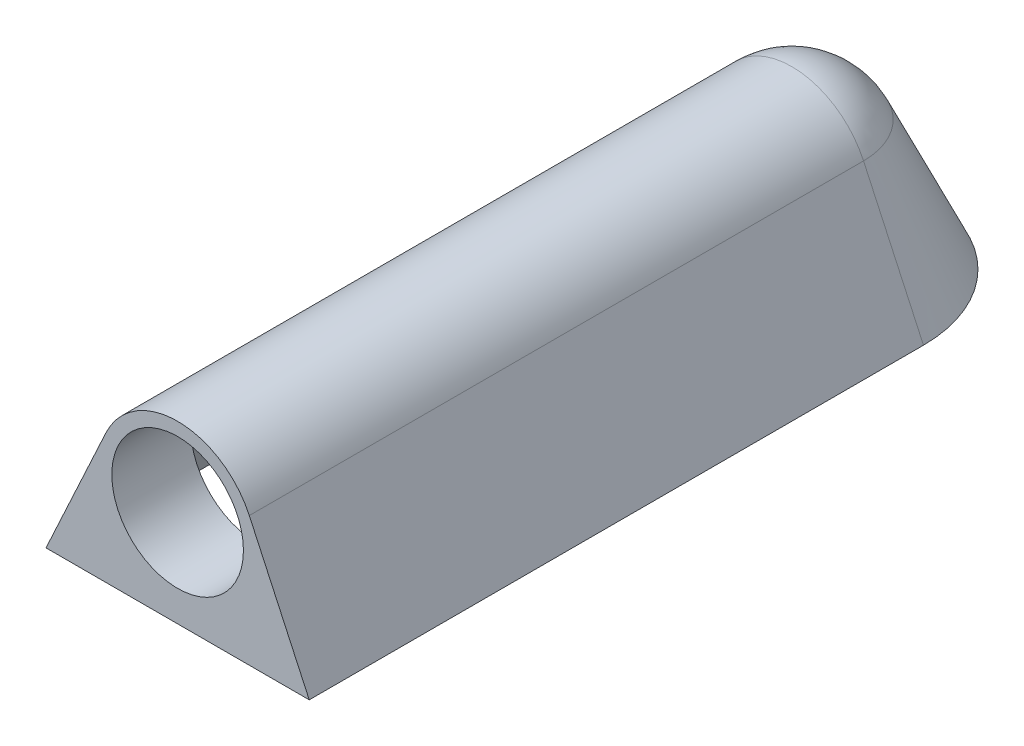
ISO-10303-21;
HEADER;
FILE_DESCRIPTION(('STEP AP214'),'2;1');
FILE_NAME('part.step','',(''),(''),'','','');
FILE_SCHEMA(('AUTOMOTIVE_DESIGN { 1 0 10303 214 1 1 1 1 }'));
ENDSEC;
DATA;
#1=APPLICATION_CONTEXT('core data for automotive mechanical design processes');
#2=APPLICATION_PROTOCOL_DEFINITION('international standard','automotive_design',2000,#1);
#3=PRODUCT_CONTEXT('',#1,'mechanical');
#4=PRODUCT('Part','Part','',(#3));
#5=PRODUCT_RELATED_PRODUCT_CATEGORY('part','',(#4));
#6=PRODUCT_DEFINITION_FORMATION('','',#4);
#7=PRODUCT_DEFINITION_CONTEXT('part definition',#1,'design');
#8=PRODUCT_DEFINITION('design','',#6,#7);
#9=PRODUCT_DEFINITION_SHAPE('','',#8);
#10=(LENGTH_UNIT() NAMED_UNIT(*) SI_UNIT(.MILLI.,.METRE.));
#11=(NAMED_UNIT(*) PLANE_ANGLE_UNIT() SI_UNIT($,.RADIAN.));
#12=(NAMED_UNIT(*) SI_UNIT($,.STERADIAN.) SOLID_ANGLE_UNIT());
#13=UNCERTAINTY_MEASURE_WITH_UNIT(LENGTH_MEASURE(1.E-05),#10,'distance_accuracy_value','');
#14=(GEOMETRIC_REPRESENTATION_CONTEXT(3) GLOBAL_UNCERTAINTY_ASSIGNED_CONTEXT((#13)) GLOBAL_UNIT_ASSIGNED_CONTEXT((#10,
#11,#12)) REPRESENTATION_CONTEXT('',''));
#15=CARTESIAN_POINT('',(0.,0.,0.));
#16=DIRECTION('',(0.,0.,1.));
#17=DIRECTION('',(1.,0.,0.));
#18=AXIS2_PLACEMENT_3D('',#15,#16,#17);
#19=CARTESIAN_POINT('',(0.,0.,0.));
#20=DIRECTION('',(0.,-1.,0.));
#21=DIRECTION('',(0.,0.,-1.));
#22=AXIS2_PLACEMENT_3D('',#19,#20,#21);
#23=PLANE('',#22);
#24=CARTESIAN_POINT('',(0.,0.,0.));
#25=DIRECTION('',(0.,-1.,0.));
#26=DIRECTION('',(0.,0.,-1.));
#27=AXIS2_PLACEMENT_3D('',#24,#25,#26);
#28=CIRCLE('',#27,13.8983243360726);
#29=CARTESIAN_POINT('',(-13.8983243360726,0.,1.01306614724094E-13));
#30=VERTEX_POINT('',#29);
#31=CARTESIAN_POINT('',(13.8983243360726,0.,0.));
#32=VERTEX_POINT('',#31);
#33=EDGE_CURVE('E145',#30,#32,#28,.T.);
#34=ORIENTED_EDGE('',*,*,#33,.F.);
#35=DIRECTION('',(0.,0.,-1.));
#36=VECTOR('',#35,1.);
#37=CARTESIAN_POINT('',(-13.8983243360726,0.,70.));
#38=LINE('',#37,#36);
#39=CARTESIAN_POINT('',(-13.8983243360726,0.,69.));
#40=VERTEX_POINT('',#39);
#41=EDGE_CURVE('E149',#40,#30,#38,.T.);
#42=ORIENTED_EDGE('',*,*,#41,.F.);
#43=DIRECTION('',(1.,0.,0.));
#44=VECTOR('',#43,1.);
#45=CARTESIAN_POINT('',(0.,0.,69.));
#46=LINE('',#45,#44);
#47=CARTESIAN_POINT('',(13.8983243360726,0.,69.));
#48=VERTEX_POINT('',#47);
#49=EDGE_CURVE('E53',#40,#48,#46,.T.);
#50=ORIENTED_EDGE('',*,*,#49,.T.);
#51=DIRECTION('',(0.,0.,-1.));
#52=VECTOR('',#51,1.);
#53=CARTESIAN_POINT('',(13.8983243360726,0.,0.));
#54=LINE('',#53,#52);
#55=EDGE_CURVE('E157',#48,#32,#54,.T.);
#56=ORIENTED_EDGE('',*,*,#55,.T.);
#57=EDGE_LOOP('',(#34,#42,#50,#56));
#58=FACE_BOUND('',#57,.T.);
#59=CARTESIAN_POINT('',(0.,0.,0.));
#60=DIRECTION('',(0.,-1.,0.));
#61=DIRECTION('',(0.,0.,-1.));
#62=AXIS2_PLACEMENT_3D('',#59,#60,#61);
#63=CIRCLE('',#62,15.);
#64=CARTESIAN_POINT('',(-15.,0.,0.));
#65=VERTEX_POINT('',#64);
#66=CARTESIAN_POINT('',(15.,0.,0.));
#67=VERTEX_POINT('',#66);
#68=EDGE_CURVE('E11',#65,#67,#63,.T.);
#69=ORIENTED_EDGE('',*,*,#68,.T.);
#70=DIRECTION('',(0.,0.,-1.));
#71=VECTOR('',#70,1.);
#72=CARTESIAN_POINT('',(15.,0.,70.));
#73=LINE('',#72,#71);
#74=CARTESIAN_POINT('',(15.,0.,70.));
#75=VERTEX_POINT('',#74);
#76=EDGE_CURVE('E200',#75,#67,#73,.T.);
#77=ORIENTED_EDGE('',*,*,#76,.F.);
#78=DIRECTION('',(1.,0.,0.));
#79=VECTOR('',#78,1.);
#80=CARTESIAN_POINT('',(-15.,0.,70.));
#81=LINE('',#80,#79);
#82=CARTESIAN_POINT('',(-15.,0.,70.));
#83=VERTEX_POINT('',#82);
#84=EDGE_CURVE('E190',#83,#75,#81,.T.);
#85=ORIENTED_EDGE('',*,*,#84,.F.);
#86=DIRECTION('',(0.,0.,-1.));
#87=VECTOR('',#86,1.);
#88=CARTESIAN_POINT('',(-15.,0.,70.));
#89=LINE('',#88,#87);
#90=EDGE_CURVE('E202',#83,#65,#89,.T.);
#91=ORIENTED_EDGE('',*,*,#90,.T.);
#92=EDGE_LOOP('',(#69,#77,#85,#91));
#93=FACE_BOUND('',#92,.T.);
#94=ADVANCED_FACE('F38',(#58,#93),#23,.T.);
#95=CARTESIAN_POINT('',(0.,0.,0.));
#96=DIRECTION('',(0.,-1.,0.));
#97=DIRECTION('',(0.,0.,-1.));
#98=AXIS2_PLACEMENT_3D('',#95,#96,#97);
#99=CONICAL_SURFACE('',#98,15.,0.433006862649807);
#100=CARTESIAN_POINT('',(0.,14.7764184406747,0.));
#101=DIRECTION('',(0.,-1.,0.));
#102=DIRECTION('',(0.,0.,-1.));
#103=AXIS2_PLACEMENT_3D('',#100,#101,#102);
#104=CIRCLE('',#103,8.16937352316148);
#105=CARTESIAN_POINT('',(-8.16937352316148,14.7764184406747,0.));
#106=VERTEX_POINT('',#105);
#107=CARTESIAN_POINT('',(8.16937352316148,14.7764184406747,0.));
#108=VERTEX_POINT('',#107);
#109=EDGE_CURVE('E46',#106,#108,#104,.T.);
#110=ORIENTED_EDGE('',*,*,#109,.T.);
#111=DIRECTION('',(-0.41960204896386,0.907708169240164,0.));
#112=VECTOR('',#111,1.);
#113=CARTESIAN_POINT('',(15.,0.,0.));
#114=LINE('',#113,#112);
#115=EDGE_CURVE('E204',#67,#108,#114,.T.);
#116=ORIENTED_EDGE('',*,*,#115,.F.);
#117=ORIENTED_EDGE('',*,*,#68,.F.);
#118=DIRECTION('',(0.41960204896386,0.907708169240164,0.));
#119=VECTOR('',#118,1.);
#120=CARTESIAN_POINT('',(-15.,0.,1.04744440165294E-13));
#121=LINE('',#120,#119);
#122=EDGE_CURVE('E206',#65,#106,#121,.T.);
#123=ORIENTED_EDGE('',*,*,#122,.T.);
#124=EDGE_LOOP('',(#110,#116,#117,#123));
#125=FACE_BOUND('',#124,.T.);
#126=ADVANCED_FACE('F40',(#125),#99,.T.);
#127=CARTESIAN_POINT('',(0.,11.,0.));
#128=DIRECTION('',(0.,-1.,0.));
#129=DIRECTION('',(-1.,0.,0.));
#130=AXIS2_PLACEMENT_3D('',#127,#128,#129);
#131=SPHERICAL_SURFACE('',#130,9.);
#132=CARTESIAN_POINT('',(0.,11.,0.));
#133=DIRECTION('',(0.,0.,-1.));
#134=DIRECTION('',(-1.,0.,0.));
#135=AXIS2_PLACEMENT_3D('',#132,#133,#134);
#136=CIRCLE('',#135,9.);
#137=EDGE_CURVE('E209',#106,#108,#136,.T.);
#138=ORIENTED_EDGE('',*,*,#137,.T.);
#139=ORIENTED_EDGE('',*,*,#109,.F.);
#140=EDGE_LOOP('',(#138,#139));
#141=FACE_BOUND('',#140,.T.);
#142=ADVANCED_FACE('F218',(#141),#131,.T.);
#143=CARTESIAN_POINT('',(-8.16937352316148,14.7764184406747,70.));
#144=DIRECTION('',(0.907708169240164,-0.41960204896386,0.));
#145=DIRECTION('',(0.41960204896386,0.907708169240164,0.));
#146=AXIS2_PLACEMENT_3D('',#143,#144,#145);
#147=PLANE('',#146);
#148=ORIENTED_EDGE('',*,*,#122,.F.);
#149=ORIENTED_EDGE('',*,*,#90,.F.);
#150=DIRECTION('',(-0.41960204896386,-0.907708169240164,0.));
#151=VECTOR('',#150,1.);
#152=CARTESIAN_POINT('',(-8.16937352316148,14.7764184406747,70.));
#153=LINE('',#152,#151);
#154=CARTESIAN_POINT('',(-8.16937352316148,14.7764184406747,70.));
#155=VERTEX_POINT('',#154);
#156=EDGE_CURVE('E187',#155,#83,#153,.T.);
#157=ORIENTED_EDGE('',*,*,#156,.F.);
#158=DIRECTION('',(0.,0.,-1.));
#159=VECTOR('',#158,1.);
#160=CARTESIAN_POINT('',(-8.16937352316148,14.7764184406747,70.));
#161=LINE('',#160,#159);
#162=EDGE_CURVE('E196',#155,#106,#161,.T.);
#163=ORIENTED_EDGE('',*,*,#162,.T.);
#164=EDGE_LOOP('',(#148,#149,#157,#163));
#165=FACE_BOUND('',#164,.T.);
#166=ADVANCED_FACE('F223',(#165),#147,.F.);
#167=CARTESIAN_POINT('',(15.,0.,70.));
#168=DIRECTION('',(-0.907708169240164,-0.41960204896386,0.));
#169=DIRECTION('',(0.41960204896386,-0.907708169240164,0.));
#170=AXIS2_PLACEMENT_3D('',#167,#168,#169);
#171=PLANE('',#170);
#172=ORIENTED_EDGE('',*,*,#115,.T.);
#173=DIRECTION('',(0.,0.,-1.));
#174=VECTOR('',#173,1.);
#175=CARTESIAN_POINT('',(8.16937352316148,14.7764184406747,70.));
#176=LINE('',#175,#174);
#177=CARTESIAN_POINT('',(8.16937352316148,14.7764184406747,70.));
#178=VERTEX_POINT('',#177);
#179=EDGE_CURVE('E61',#178,#108,#176,.T.);
#180=ORIENTED_EDGE('',*,*,#179,.F.);
#181=DIRECTION('',(-0.41960204896386,0.907708169240164,0.));
#182=VECTOR('',#181,1.);
#183=CARTESIAN_POINT('',(15.,0.,70.));
#184=LINE('',#183,#182);
#185=EDGE_CURVE('E192',#75,#178,#184,.T.);
#186=ORIENTED_EDGE('',*,*,#185,.F.);
#187=ORIENTED_EDGE('',*,*,#76,.T.);
#188=EDGE_LOOP('',(#172,#180,#186,#187));
#189=FACE_BOUND('',#188,.T.);
#190=ADVANCED_FACE('F230',(#189),#171,.F.);
#191=CARTESIAN_POINT('',(0.,11.,70.));
#192=DIRECTION('',(0.,0.,-1.));
#193=DIRECTION('',(-1.,0.,0.));
#194=AXIS2_PLACEMENT_3D('',#191,#192,#193);
#195=CYLINDRICAL_SURFACE('',#194,9.);
#196=ORIENTED_EDGE('',*,*,#137,.F.);
#197=ORIENTED_EDGE('',*,*,#162,.F.);
#198=CARTESIAN_POINT('',(0.,11.,70.));
#199=DIRECTION('',(0.,0.,1.));
#200=DIRECTION('',(1.,0.,0.));
#201=AXIS2_PLACEMENT_3D('',#198,#199,#200);
#202=CIRCLE('',#201,9.);
#203=EDGE_CURVE('E194',#178,#155,#202,.T.);
#204=ORIENTED_EDGE('',*,*,#203,.F.);
#205=ORIENTED_EDGE('',*,*,#179,.T.);
#206=EDGE_LOOP('',(#196,#197,#204,#205));
#207=FACE_BOUND('',#206,.T.);
#208=ADVANCED_FACE('F220',(#207),#195,.T.);
#209=CARTESIAN_POINT('',(0.,11.,70.));
#210=DIRECTION('',(0.,0.,1.));
#211=DIRECTION('',(1.,0.,0.));
#212=AXIS2_PLACEMENT_3D('',#209,#210,#211);
#213=PLANE('',#212);
#214=CARTESIAN_POINT('',(0.,11.,70.));
#215=DIRECTION('',(0.,0.,1.));
#216=DIRECTION('',(1.,0.,0.));
#217=AXIS2_PLACEMENT_3D('',#214,#215,#216);
#218=CIRCLE('',#217,7.5);
#219=CARTESIAN_POINT('',(7.5,11.,70.));
#220=VERTEX_POINT('',#219);
#221=EDGE_CURVE('E184',#220,#220,#218,.T.);
#222=ORIENTED_EDGE('',*,*,#221,.F.);
#223=EDGE_LOOP('',(#222));
#224=FACE_BOUND('',#223,.T.);
#225=ORIENTED_EDGE('',*,*,#156,.T.);
#226=ORIENTED_EDGE('',*,*,#84,.T.);
#227=ORIENTED_EDGE('',*,*,#185,.T.);
#228=ORIENTED_EDGE('',*,*,#203,.T.);
#229=EDGE_LOOP('',(#225,#226,#227,#228));
#230=FACE_BOUND('',#229,.T.);
#231=ADVANCED_FACE('F226',(#224,#230),#213,.T.);
#232=CARTESIAN_POINT('',(0.,11.,61.));
#233=DIRECTION('',(0.,0.,1.));
#234=DIRECTION('',(1.,0.,0.));
#235=AXIS2_PLACEMENT_3D('',#232,#233,#234);
#236=CYLINDRICAL_SURFACE('',#235,7.5);
#237=CARTESIAN_POINT('',(0.,11.,61.));
#238=DIRECTION('',(0.,0.,1.));
#239=DIRECTION('',(1.,0.,0.));
#240=AXIS2_PLACEMENT_3D('',#237,#238,#239);
#241=CIRCLE('',#240,7.5);
#242=CARTESIAN_POINT('',(7.5,11.,61.));
#243=VERTEX_POINT('',#242);
#244=EDGE_CURVE('E181',#243,#243,#241,.T.);
#245=ORIENTED_EDGE('',*,*,#244,.F.);
#246=EDGE_LOOP('',(#245));
#247=FACE_BOUND('',#246,.T.);
#248=ORIENTED_EDGE('',*,*,#221,.T.);
#249=EDGE_LOOP('',(#248));
#250=FACE_BOUND('',#249,.T.);
#251=ADVANCED_FACE('F256',(#247,#250),#236,.F.);
#252=CARTESIAN_POINT('',(-7.26166535392131,14.3568163917109,70.));
#253=DIRECTION('',(0.907708169240164,-0.41960204896386,0.));
#254=DIRECTION('',(0.41960204896386,0.907708169240164,0.));
#255=AXIS2_PLACEMENT_3D('',#252,#253,#254);
#256=PLANE('',#255);
#257=DIRECTION('',(-0.41960204896386,-0.907708169240164,0.));
#258=VECTOR('',#257,1.);
#259=CARTESIAN_POINT('',(-7.26166535392131,14.3568163917109,61.));
#260=LINE('',#259,#258);
#261=CARTESIAN_POINT('',(-7.26166535392131,14.3568163917109,61.));
#262=VERTEX_POINT('',#261);
#263=CARTESIAN_POINT('',(-8.46688048236562,11.7496231702236,61.));
#264=VERTEX_POINT('',#263);
#265=EDGE_CURVE('E176',#262,#264,#260,.T.);
#266=ORIENTED_EDGE('',*,*,#265,.T.);
#267=DIRECTION('',(0.,0.,1.));
#268=VECTOR('',#267,1.);
#269=CARTESIAN_POINT('',(-8.46688048236562,11.7496231702236,61.));
#270=LINE('',#269,#268);
#271=CARTESIAN_POINT('',(-8.46688048236562,11.7496231702236,69.));
#272=VERTEX_POINT('',#271);
#273=EDGE_CURVE('E164',#272,#264,#270,.F.);
#274=ORIENTED_EDGE('',*,*,#273,.F.);
#275=DIRECTION('',(-0.41960204896386,-0.907708169240164,0.));
#276=VECTOR('',#275,1.);
#277=CARTESIAN_POINT('',(-7.26166535392131,14.3568163917109,69.));
#278=LINE('',#277,#276);
#279=EDGE_CURVE('E153',#272,#40,#278,.T.);
#280=ORIENTED_EDGE('',*,*,#279,.T.);
#281=ORIENTED_EDGE('',*,*,#41,.T.);
#282=DIRECTION('',(-0.41960204896386,-0.907708169240164,0.));
#283=VECTOR('',#282,1.);
#284=CARTESIAN_POINT('',(-14.0922918307598,-0.41960204896386,1.02720467918057E-13));
#285=LINE('',#284,#283);
#286=CARTESIAN_POINT('',(-7.26166535392131,14.3568163917109,0.));
#287=VERTEX_POINT('',#286);
#288=EDGE_CURVE('E136',#30,#287,#285,.F.);
#289=ORIENTED_EDGE('',*,*,#288,.T.);
#290=DIRECTION('',(0.,0.,1.));
#291=VECTOR('',#290,1.);
#292=CARTESIAN_POINT('',(-7.26166535392131,14.3568163917109,70.));
#293=LINE('',#292,#291);
#294=EDGE_CURVE('E118',#262,#287,#293,.F.);
#295=ORIENTED_EDGE('',*,*,#294,.F.);
#296=EDGE_LOOP('',(#266,#274,#280,#281,#289,#295));
#297=FACE_BOUND('',#296,.T.);
#298=ADVANCED_FACE('F147',(#297),#256,.T.);
#299=CARTESIAN_POINT('',(0.,-0.41960204896386,0.));
#300=DIRECTION('',(0.,-1.,0.));
#301=DIRECTION('',(0.,0.,-1.));
#302=AXIS2_PLACEMENT_3D('',#299,#300,#301);
#303=CONICAL_SURFACE('',#302,14.0922918307598,0.433006862649807);
#304=CARTESIAN_POINT('',(0.,14.3568163917109,0.));
#305=DIRECTION('',(0.,-1.,0.));
#306=DIRECTION('',(0.,0.,-1.));
#307=AXIS2_PLACEMENT_3D('',#304,#305,#306);
#308=CIRCLE('',#307,7.26166535392131);
#309=CARTESIAN_POINT('',(7.26166535392131,14.3568163917109,0.));
#310=VERTEX_POINT('',#309);
#311=EDGE_CURVE('E135',#287,#310,#308,.T.);
#312=ORIENTED_EDGE('',*,*,#311,.F.);
#313=ORIENTED_EDGE('',*,*,#288,.F.);
#314=ORIENTED_EDGE('',*,*,#33,.T.);
#315=DIRECTION('',(0.41960204896386,-0.907708169240164,0.));
#316=VECTOR('',#315,1.);
#317=CARTESIAN_POINT('',(14.0922918307598,-0.41960204896386,0.));
#318=LINE('',#317,#316);
#319=EDGE_CURVE('E144',#32,#310,#318,.F.);
#320=ORIENTED_EDGE('',*,*,#319,.T.);
#321=EDGE_LOOP('',(#312,#313,#314,#320));
#322=FACE_BOUND('',#321,.T.);
#323=ADVANCED_FACE('F141',(#322),#303,.F.);
#324=CARTESIAN_POINT('',(0.,11.,0.));
#325=DIRECTION('',(0.,-1.,0.));
#326=DIRECTION('',(-1.,0.,0.));
#327=AXIS2_PLACEMENT_3D('',#324,#325,#326);
#328=SPHERICAL_SURFACE('',#327,8.);
#329=CARTESIAN_POINT('',(0.,11.,0.));
#330=DIRECTION('',(0.,0.,-1.));
#331=DIRECTION('',(-1.,0.,0.));
#332=AXIS2_PLACEMENT_3D('',#329,#330,#331);
#333=CIRCLE('',#332,8.);
#334=EDGE_CURVE('E122',#287,#310,#333,.T.);
#335=ORIENTED_EDGE('',*,*,#334,.F.);
#336=ORIENTED_EDGE('',*,*,#311,.T.);
#337=EDGE_LOOP('',(#335,#336));
#338=FACE_BOUND('',#337,.T.);
#339=ADVANCED_FACE('F134',(#338),#328,.F.);
#340=CARTESIAN_POINT('',(14.0922918307598,-0.41960204896386,70.));
#341=DIRECTION('',(-0.907708169240164,-0.41960204896386,0.));
#342=DIRECTION('',(0.41960204896386,-0.907708169240164,0.));
#343=AXIS2_PLACEMENT_3D('',#340,#341,#342);
#344=PLANE('',#343);
#345=DIRECTION('',(0.,0.,-1.));
#346=VECTOR('',#345,1.);
#347=CARTESIAN_POINT('',(7.26166535392131,14.3568163917109,70.));
#348=LINE('',#347,#346);
#349=CARTESIAN_POINT('',(7.26166535392131,14.3568163917109,61.));
#350=VERTEX_POINT('',#349);
#351=EDGE_CURVE('E129',#350,#310,#348,.T.);
#352=ORIENTED_EDGE('',*,*,#351,.T.);
#353=ORIENTED_EDGE('',*,*,#319,.F.);
#354=ORIENTED_EDGE('',*,*,#55,.F.);
#355=DIRECTION('',(-0.41960204896386,0.907708169240164,0.));
#356=VECTOR('',#355,1.);
#357=CARTESIAN_POINT('',(14.0922918307598,-0.41960204896386,69.));
#358=LINE('',#357,#356);
#359=CARTESIAN_POINT('',(8.46688048236562,11.7496231702236,69.));
#360=VERTEX_POINT('',#359);
#361=EDGE_CURVE('E130',#48,#360,#358,.T.);
#362=ORIENTED_EDGE('',*,*,#361,.T.);
#363=DIRECTION('',(0.,0.,1.));
#364=VECTOR('',#363,1.);
#365=CARTESIAN_POINT('',(8.46688048236562,11.7496231702236,61.));
#366=LINE('',#365,#364);
#367=CARTESIAN_POINT('',(8.46688048236562,11.7496231702236,61.));
#368=VERTEX_POINT('',#367);
#369=EDGE_CURVE('E173',#360,#368,#366,.F.);
#370=ORIENTED_EDGE('',*,*,#369,.T.);
#371=DIRECTION('',(0.41960204896386,-0.907708169240164,0.));
#372=VECTOR('',#371,1.);
#373=CARTESIAN_POINT('',(7.26166535392131,14.3568163917109,61.));
#374=LINE('',#373,#372);
#375=EDGE_CURVE('E178',#350,#368,#374,.T.);
#376=ORIENTED_EDGE('',*,*,#375,.F.);
#377=EDGE_LOOP('',(#352,#353,#354,#362,#370,#376));
#378=FACE_BOUND('',#377,.T.);
#379=ADVANCED_FACE('F270',(#378),#344,.T.);
#380=CARTESIAN_POINT('',(0.,11.,70.));
#381=DIRECTION('',(0.,0.,-1.));
#382=DIRECTION('',(-1.,0.,0.));
#383=AXIS2_PLACEMENT_3D('',#380,#381,#382);
#384=CYLINDRICAL_SURFACE('',#383,8.);
#385=ORIENTED_EDGE('',*,*,#294,.T.);
#386=ORIENTED_EDGE('',*,*,#334,.T.);
#387=ORIENTED_EDGE('',*,*,#351,.F.);
#388=CARTESIAN_POINT('',(0.,11.,61.));
#389=DIRECTION('',(0.,0.,1.));
#390=DIRECTION('',(1.,0.,0.));
#391=AXIS2_PLACEMENT_3D('',#388,#389,#390);
#392=CIRCLE('',#391,8.);
#393=EDGE_CURVE('E125',#262,#350,#392,.F.);
#394=ORIENTED_EDGE('',*,*,#393,.F.);
#395=EDGE_LOOP('',(#385,#386,#387,#394));
#396=FACE_BOUND('',#395,.T.);
#397=ADVANCED_FACE('F120',(#396),#384,.F.);
#398=CARTESIAN_POINT('',(0.,11.,69.));
#399=DIRECTION('',(0.,0.,1.));
#400=DIRECTION('',(1.,0.,0.));
#401=AXIS2_PLACEMENT_3D('',#398,#399,#400);
#402=PLANE('',#401);
#403=CARTESIAN_POINT('',(0.,11.,69.));
#404=DIRECTION('',(0.,0.,1.));
#405=DIRECTION('',(1.,0.,0.));
#406=AXIS2_PLACEMENT_3D('',#403,#404,#405);
#407=CIRCLE('',#406,8.5);
#408=EDGE_CURVE('E160',#272,#360,#407,.T.);
#409=ORIENTED_EDGE('',*,*,#408,.T.);
#410=ORIENTED_EDGE('',*,*,#361,.F.);
#411=ORIENTED_EDGE('',*,*,#49,.F.);
#412=ORIENTED_EDGE('',*,*,#279,.F.);
#413=EDGE_LOOP('',(#409,#410,#411,#412));
#414=FACE_BOUND('',#413,.T.);
#415=ADVANCED_FACE('F264',(#414),#402,.F.);
#416=CARTESIAN_POINT('',(0.,11.,61.));
#417=DIRECTION('',(0.,0.,1.));
#418=DIRECTION('',(1.,0.,0.));
#419=AXIS2_PLACEMENT_3D('',#416,#417,#418);
#420=CYLINDRICAL_SURFACE('',#419,8.5);
#421=ORIENTED_EDGE('',*,*,#408,.F.);
#422=ORIENTED_EDGE('',*,*,#273,.T.);
#423=CARTESIAN_POINT('',(0.,11.,61.));
#424=DIRECTION('',(0.,0.,1.));
#425=DIRECTION('',(1.,0.,0.));
#426=AXIS2_PLACEMENT_3D('',#423,#424,#425);
#427=CIRCLE('',#426,8.5);
#428=EDGE_CURVE('E154',#264,#368,#427,.T.);
#429=ORIENTED_EDGE('',*,*,#428,.T.);
#430=ORIENTED_EDGE('',*,*,#369,.F.);
#431=EDGE_LOOP('',(#421,#422,#429,#430));
#432=FACE_BOUND('',#431,.T.);
#433=ADVANCED_FACE('F260',(#432),#420,.T.);
#434=CARTESIAN_POINT('',(0.,11.,61.));
#435=DIRECTION('',(0.,0.,1.));
#436=DIRECTION('',(1.,0.,0.));
#437=AXIS2_PLACEMENT_3D('',#434,#435,#436);
#438=PLANE('',#437);
#439=ORIENTED_EDGE('',*,*,#244,.T.);
#440=EDGE_LOOP('',(#439));
#441=FACE_BOUND('',#440,.T.);
#442=ORIENTED_EDGE('',*,*,#393,.T.);
#443=ORIENTED_EDGE('',*,*,#375,.T.);
#444=ORIENTED_EDGE('',*,*,#428,.F.);
#445=ORIENTED_EDGE('',*,*,#265,.F.);
#446=EDGE_LOOP('',(#442,#443,#444,#445));
#447=FACE_BOUND('',#446,.T.);
#448=ADVANCED_FACE('F263',(#441,#447),#438,.F.);
#449=CLOSED_SHELL('',(#94,#126,#142,#166,#190,#208,#231,#251,#298,#323,#339,#379,#397,#415,#433,#448));
#450=MANIFOLD_SOLID_BREP('B2',#449);
#451=ADVANCED_BREP_SHAPE_REPRESENTATION('',(#18,#450),#14);
#452=SHAPE_DEFINITION_REPRESENTATION(#9,#451);
ENDSEC;
END-ISO-10303-21;
